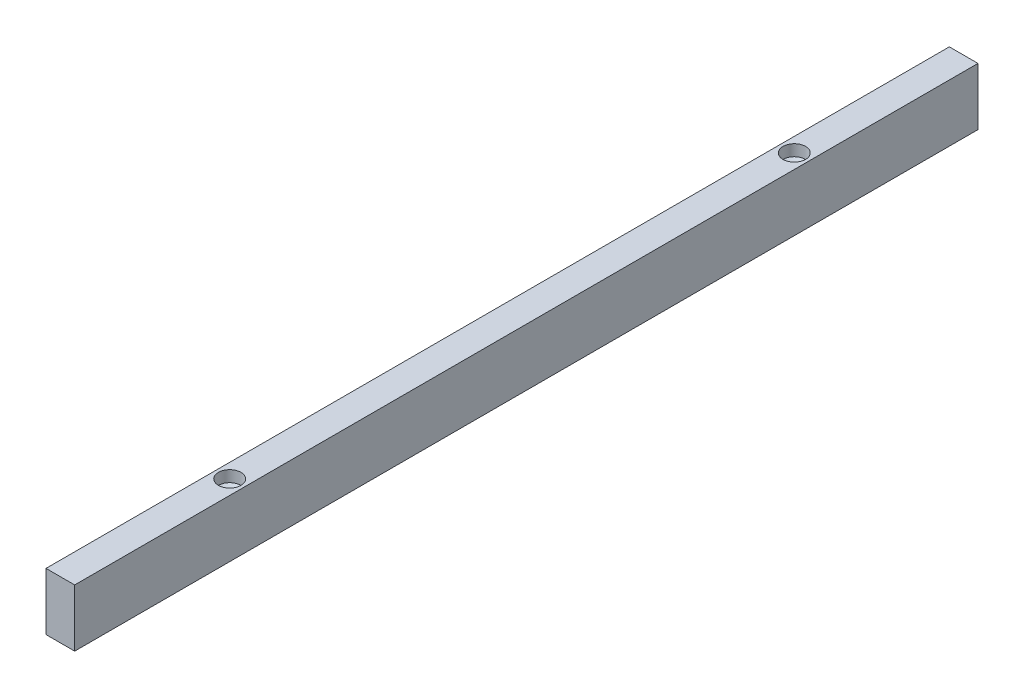
ISO-10303-21;
HEADER;
FILE_DESCRIPTION(('STEP AP214'),'2;1');
FILE_NAME('part.step','',(''),(''),'','','');
FILE_SCHEMA(('AUTOMOTIVE_DESIGN { 1 0 10303 214 1 1 1 1 }'));
ENDSEC;
DATA;
#1=APPLICATION_CONTEXT('core data for automotive mechanical design processes');
#2=APPLICATION_PROTOCOL_DEFINITION('international standard','automotive_design',2000,#1);
#3=PRODUCT_CONTEXT('',#1,'mechanical');
#4=PRODUCT('Part','Part','',(#3));
#5=PRODUCT_RELATED_PRODUCT_CATEGORY('part','',(#4));
#6=PRODUCT_DEFINITION_FORMATION('','',#4);
#7=PRODUCT_DEFINITION_CONTEXT('part definition',#1,'design');
#8=PRODUCT_DEFINITION('design','',#6,#7);
#9=PRODUCT_DEFINITION_SHAPE('','',#8);
#10=(LENGTH_UNIT() NAMED_UNIT(*) SI_UNIT(.MILLI.,.METRE.));
#11=(NAMED_UNIT(*) PLANE_ANGLE_UNIT() SI_UNIT($,.RADIAN.));
#12=(NAMED_UNIT(*) SI_UNIT($,.STERADIAN.) SOLID_ANGLE_UNIT());
#13=UNCERTAINTY_MEASURE_WITH_UNIT(LENGTH_MEASURE(1.E-05),#10,'distance_accuracy_value','');
#14=(GEOMETRIC_REPRESENTATION_CONTEXT(3) GLOBAL_UNCERTAINTY_ASSIGNED_CONTEXT((#13)) GLOBAL_UNIT_ASSIGNED_CONTEXT((#10,
#11,#12)) REPRESENTATION_CONTEXT('',''));
#15=CARTESIAN_POINT('',(0.,0.,0.));
#16=DIRECTION('',(0.,0.,1.));
#17=DIRECTION('',(1.,0.,0.));
#18=AXIS2_PLACEMENT_3D('',#15,#16,#17);
#19=CARTESIAN_POINT('',(6.35,-12.7,-200.));
#20=DIRECTION('',(1.,0.,0.));
#21=DIRECTION('',(0.,1.,0.));
#22=AXIS2_PLACEMENT_3D('',#19,#20,#21);
#23=PLANE('',#22);
#24=DIRECTION('',(0.,0.,1.));
#25=VECTOR('',#24,1.);
#26=CARTESIAN_POINT('',(6.35,12.7,-200.));
#27=LINE('',#26,#25);
#28=CARTESIAN_POINT('',(6.35,12.7,-200.));
#29=VERTEX_POINT('',#28);
#30=CARTESIAN_POINT('',(6.35,12.7,200.));
#31=VERTEX_POINT('',#30);
#32=EDGE_CURVE('E33',#29,#31,#27,.T.);
#33=ORIENTED_EDGE('',*,*,#32,.T.);
#34=DIRECTION('',(0.,1.,0.));
#35=VECTOR('',#34,1.);
#36=CARTESIAN_POINT('',(6.35,-12.7,200.));
#37=LINE('',#36,#35);
#38=CARTESIAN_POINT('',(6.35,-12.7,200.));
#39=VERTEX_POINT('',#38);
#40=EDGE_CURVE('E70',#39,#31,#37,.T.);
#41=ORIENTED_EDGE('',*,*,#40,.F.);
#42=DIRECTION('',(0.,0.,1.));
#43=VECTOR('',#42,1.);
#44=CARTESIAN_POINT('',(6.35,-12.7,-200.));
#45=LINE('',#44,#43);
#46=CARTESIAN_POINT('',(6.35,-12.7,-200.));
#47=VERTEX_POINT('',#46);
#48=EDGE_CURVE('E11',#47,#39,#45,.T.);
#49=ORIENTED_EDGE('',*,*,#48,.F.);
#50=DIRECTION('',(0.,1.,0.));
#51=VECTOR('',#50,1.);
#52=CARTESIAN_POINT('',(6.35,-12.7,-200.));
#53=LINE('',#52,#51);
#54=EDGE_CURVE('E71',#47,#29,#53,.T.);
#55=ORIENTED_EDGE('',*,*,#54,.T.);
#56=EDGE_LOOP('',(#33,#41,#49,#55));
#57=FACE_BOUND('',#56,.T.);
#58=ADVANCED_FACE('F30',(#57),#23,.T.);
#59=CARTESIAN_POINT('',(6.35,-12.7,-200.));
#60=DIRECTION('',(0.,-1.,0.));
#61=DIRECTION('',(0.,0.,-1.));
#62=AXIS2_PLACEMENT_3D('',#59,#60,#61);
#63=PLANE('',#62);
#64=CARTESIAN_POINT('',(0.,-12.7,-125.));
#65=DIRECTION('',(0.,1.,0.));
#66=DIRECTION('',(0.,0.,1.));
#67=AXIS2_PLACEMENT_3D('',#64,#65,#66);
#68=CIRCLE('',#67,1.65);
#69=CARTESIAN_POINT('',(0.,-12.7,-123.35));
#70=VERTEX_POINT('',#69);
#71=EDGE_CURVE('E134',#70,#70,#68,.T.);
#72=ORIENTED_EDGE('',*,*,#71,.T.);
#73=EDGE_LOOP('',(#72));
#74=FACE_BOUND('',#73,.T.);
#75=CARTESIAN_POINT('',(0.,-12.7,125.));
#76=DIRECTION('',(0.,-1.,0.));
#77=DIRECTION('',(0.,0.,-1.));
#78=AXIS2_PLACEMENT_3D('',#75,#76,#77);
#79=CIRCLE('',#78,1.65);
#80=CARTESIAN_POINT('',(0.,-12.7,123.35));
#81=VERTEX_POINT('',#80);
#82=EDGE_CURVE('E137',#81,#81,#79,.T.);
#83=ORIENTED_EDGE('',*,*,#82,.F.);
#84=EDGE_LOOP('',(#83));
#85=FACE_BOUND('',#84,.T.);
#86=ORIENTED_EDGE('',*,*,#48,.T.);
#87=DIRECTION('',(1.,0.,0.));
#88=VECTOR('',#87,1.);
#89=CARTESIAN_POINT('',(6.35,-12.7,200.));
#90=LINE('',#89,#88);
#91=CARTESIAN_POINT('',(-6.35,-12.7,200.));
#92=VERTEX_POINT('',#91);
#93=EDGE_CURVE('E87',#92,#39,#90,.T.);
#94=ORIENTED_EDGE('',*,*,#93,.F.);
#95=DIRECTION('',(0.,0.,1.));
#96=VECTOR('',#95,1.);
#97=CARTESIAN_POINT('',(-6.35,-12.7,-200.));
#98=LINE('',#97,#96);
#99=CARTESIAN_POINT('',(-6.35,-12.7,-200.));
#100=VERTEX_POINT('',#99);
#101=EDGE_CURVE('E38',#100,#92,#98,.T.);
#102=ORIENTED_EDGE('',*,*,#101,.F.);
#103=DIRECTION('',(1.,0.,0.));
#104=VECTOR('',#103,1.);
#105=CARTESIAN_POINT('',(6.35,-12.7,-200.));
#106=LINE('',#105,#104);
#107=EDGE_CURVE('E76',#100,#47,#106,.T.);
#108=ORIENTED_EDGE('',*,*,#107,.T.);
#109=EDGE_LOOP('',(#86,#94,#102,#108));
#110=FACE_BOUND('',#109,.T.);
#111=ADVANCED_FACE('F107',(#74,#85,#110),#63,.T.);
#112=CARTESIAN_POINT('',(-6.35,-12.7,-200.));
#113=DIRECTION('',(-1.,0.,0.));
#114=DIRECTION('',(0.,-1.,0.));
#115=AXIS2_PLACEMENT_3D('',#112,#113,#114);
#116=PLANE('',#115);
#117=ORIENTED_EDGE('',*,*,#101,.T.);
#118=DIRECTION('',(0.,-1.,0.));
#119=VECTOR('',#118,1.);
#120=CARTESIAN_POINT('',(-6.35,-12.7,200.));
#121=LINE('',#120,#119);
#122=CARTESIAN_POINT('',(-6.35,12.7,200.));
#123=VERTEX_POINT('',#122);
#124=EDGE_CURVE('E83',#123,#92,#121,.T.);
#125=ORIENTED_EDGE('',*,*,#124,.F.);
#126=DIRECTION('',(0.,0.,1.));
#127=VECTOR('',#126,1.);
#128=CARTESIAN_POINT('',(-6.35,12.7,-200.));
#129=LINE('',#128,#127);
#130=CARTESIAN_POINT('',(-6.35,12.7,-200.));
#131=VERTEX_POINT('',#130);
#132=EDGE_CURVE('E75',#131,#123,#129,.T.);
#133=ORIENTED_EDGE('',*,*,#132,.F.);
#134=DIRECTION('',(0.,-1.,0.));
#135=VECTOR('',#134,1.);
#136=CARTESIAN_POINT('',(-6.35,-12.7,-200.));
#137=LINE('',#136,#135);
#138=EDGE_CURVE('E100',#131,#100,#137,.T.);
#139=ORIENTED_EDGE('',*,*,#138,.T.);
#140=EDGE_LOOP('',(#117,#125,#133,#139));
#141=FACE_BOUND('',#140,.T.);
#142=ADVANCED_FACE('F104',(#141),#116,.T.);
#143=CARTESIAN_POINT('',(6.35,12.7,-200.));
#144=DIRECTION('',(0.,1.,0.));
#145=DIRECTION('',(0.,0.,1.));
#146=AXIS2_PLACEMENT_3D('',#143,#144,#145);
#147=PLANE('',#146);
#148=CARTESIAN_POINT('',(0.,12.7,-125.));
#149=DIRECTION('',(0.,1.,0.));
#150=DIRECTION('',(0.,0.,1.));
#151=AXIS2_PLACEMENT_3D('',#148,#149,#150);
#152=CIRCLE('',#151,5.);
#153=CARTESIAN_POINT('',(0.,12.7,-120.));
#154=VERTEX_POINT('',#153);
#155=EDGE_CURVE('E140',#154,#154,#152,.T.);
#156=ORIENTED_EDGE('',*,*,#155,.F.);
#157=EDGE_LOOP('',(#156));
#158=FACE_BOUND('',#157,.T.);
#159=CARTESIAN_POINT('',(0.,12.7,125.));
#160=DIRECTION('',(0.,-1.,0.));
#161=DIRECTION('',(0.,0.,-1.));
#162=AXIS2_PLACEMENT_3D('',#159,#160,#161);
#163=CIRCLE('',#162,5.);
#164=CARTESIAN_POINT('',(0.,12.7,120.));
#165=VERTEX_POINT('',#164);
#166=EDGE_CURVE('E88',#165,#165,#163,.T.);
#167=ORIENTED_EDGE('',*,*,#166,.T.);
#168=EDGE_LOOP('',(#167));
#169=FACE_BOUND('',#168,.T.);
#170=ORIENTED_EDGE('',*,*,#132,.T.);
#171=DIRECTION('',(-1.,0.,0.));
#172=VECTOR('',#171,1.);
#173=CARTESIAN_POINT('',(6.35,12.7,200.));
#174=LINE('',#173,#172);
#175=EDGE_CURVE('E78',#31,#123,#174,.T.);
#176=ORIENTED_EDGE('',*,*,#175,.F.);
#177=ORIENTED_EDGE('',*,*,#32,.F.);
#178=DIRECTION('',(-1.,0.,0.));
#179=VECTOR('',#178,1.);
#180=CARTESIAN_POINT('',(6.35,12.7,-200.));
#181=LINE('',#180,#179);
#182=EDGE_CURVE('E98',#29,#131,#181,.T.);
#183=ORIENTED_EDGE('',*,*,#182,.T.);
#184=EDGE_LOOP('',(#170,#176,#177,#183));
#185=FACE_BOUND('',#184,.T.);
#186=ADVANCED_FACE('F79',(#158,#169,#185),#147,.T.);
#187=CARTESIAN_POINT('',(6.35,12.7,-200.));
#188=DIRECTION('',(0.,0.,1.));
#189=DIRECTION('',(1.,0.,0.));
#190=AXIS2_PLACEMENT_3D('',#187,#188,#189);
#191=PLANE('',#190);
#192=ORIENTED_EDGE('',*,*,#54,.F.);
#193=ORIENTED_EDGE('',*,*,#107,.F.);
#194=ORIENTED_EDGE('',*,*,#138,.F.);
#195=ORIENTED_EDGE('',*,*,#182,.F.);
#196=EDGE_LOOP('',(#192,#193,#194,#195));
#197=FACE_BOUND('',#196,.T.);
#198=ADVANCED_FACE('F109',(#197),#191,.F.);
#199=CARTESIAN_POINT('',(6.35,12.7,200.));
#200=DIRECTION('',(0.,0.,1.));
#201=DIRECTION('',(1.,0.,0.));
#202=AXIS2_PLACEMENT_3D('',#199,#200,#201);
#203=PLANE('',#202);
#204=ORIENTED_EDGE('',*,*,#40,.T.);
#205=ORIENTED_EDGE('',*,*,#175,.T.);
#206=ORIENTED_EDGE('',*,*,#124,.T.);
#207=ORIENTED_EDGE('',*,*,#93,.T.);
#208=EDGE_LOOP('',(#204,#205,#206,#207));
#209=FACE_BOUND('',#208,.T.);
#210=ADVANCED_FACE('F86',(#209),#203,.T.);
#211=CARTESIAN_POINT('',(0.,-12.7,125.));
#212=DIRECTION('',(0.,-1.,0.));
#213=DIRECTION('',(0.,0.,-1.));
#214=AXIS2_PLACEMENT_3D('',#211,#212,#213);
#215=CYLINDRICAL_SURFACE('',#214,5.);
#216=ORIENTED_EDGE('',*,*,#166,.F.);
#217=EDGE_LOOP('',(#216));
#218=FACE_BOUND('',#217,.T.);
#219=CARTESIAN_POINT('',(0.,7.7,125.));
#220=DIRECTION('',(0.,-1.,0.));
#221=DIRECTION('',(0.,0.,-1.));
#222=AXIS2_PLACEMENT_3D('',#219,#220,#221);
#223=CIRCLE('',#222,5.);
#224=CARTESIAN_POINT('',(0.,7.7,120.));
#225=VERTEX_POINT('',#224);
#226=EDGE_CURVE('E91',#225,#225,#223,.T.);
#227=ORIENTED_EDGE('',*,*,#226,.T.);
#228=EDGE_LOOP('',(#227));
#229=FACE_BOUND('',#228,.T.);
#230=ADVANCED_FACE('F116',(#218,#229),#215,.F.);
#231=CARTESIAN_POINT('',(0.,6.54529946162073,125.));
#232=DIRECTION('',(0.,1.,0.));
#233=DIRECTION('',(0.,0.,1.));
#234=AXIS2_PLACEMENT_3D('',#231,#232,#233);
#235=CONICAL_SURFACE('',#234,3.,1.04719755119659);
#236=ORIENTED_EDGE('',*,*,#226,.F.);
#237=EDGE_LOOP('',(#236));
#238=FACE_BOUND('',#237,.T.);
#239=CARTESIAN_POINT('',(0.,6.54529946162073,125.));
#240=DIRECTION('',(0.,-1.,0.));
#241=DIRECTION('',(0.,0.,-1.));
#242=AXIS2_PLACEMENT_3D('',#239,#240,#241);
#243=CIRCLE('',#242,3.);
#244=CARTESIAN_POINT('',(0.,6.54529946162073,122.));
#245=VERTEX_POINT('',#244);
#246=EDGE_CURVE('E152',#245,#245,#243,.T.);
#247=ORIENTED_EDGE('',*,*,#246,.T.);
#248=EDGE_LOOP('',(#247));
#249=FACE_BOUND('',#248,.T.);
#250=ADVANCED_FACE('F158',(#238,#249),#235,.F.);
#251=CARTESIAN_POINT('',(0.,-12.7,125.));
#252=DIRECTION('',(0.,-1.,0.));
#253=DIRECTION('',(0.,0.,-1.));
#254=AXIS2_PLACEMENT_3D('',#251,#252,#253);
#255=CYLINDRICAL_SURFACE('',#254,3.);
#256=ORIENTED_EDGE('',*,*,#246,.F.);
#257=EDGE_LOOP('',(#256));
#258=FACE_BOUND('',#257,.T.);
#259=CARTESIAN_POINT('',(0.,-2.3,125.));
#260=DIRECTION('',(0.,-1.,0.));
#261=DIRECTION('',(0.,0.,-1.));
#262=AXIS2_PLACEMENT_3D('',#259,#260,#261);
#263=CIRCLE('',#262,3.);
#264=CARTESIAN_POINT('',(0.,-2.3,122.));
#265=VERTEX_POINT('',#264);
#266=EDGE_CURVE('E143',#265,#265,#263,.T.);
#267=ORIENTED_EDGE('',*,*,#266,.T.);
#268=EDGE_LOOP('',(#267));
#269=FACE_BOUND('',#268,.T.);
#270=ADVANCED_FACE('F161',(#258,#269),#255,.F.);
#271=CARTESIAN_POINT('',(0.,-3.07942286340601,125.));
#272=DIRECTION('',(0.,1.,0.));
#273=DIRECTION('',(0.,0.,1.));
#274=AXIS2_PLACEMENT_3D('',#271,#272,#273);
#275=CONICAL_SURFACE('',#274,1.65,1.04719755119659);
#276=ORIENTED_EDGE('',*,*,#266,.F.);
#277=EDGE_LOOP('',(#276));
#278=FACE_BOUND('',#277,.T.);
#279=CARTESIAN_POINT('',(0.,-3.07942286340601,125.));
#280=DIRECTION('',(0.,-1.,0.));
#281=DIRECTION('',(0.,0.,-1.));
#282=AXIS2_PLACEMENT_3D('',#279,#280,#281);
#283=CIRCLE('',#282,1.65);
#284=CARTESIAN_POINT('',(0.,-3.07942286340601,123.35));
#285=VERTEX_POINT('',#284);
#286=EDGE_CURVE('E139',#285,#285,#283,.T.);
#287=ORIENTED_EDGE('',*,*,#286,.T.);
#288=EDGE_LOOP('',(#287));
#289=FACE_BOUND('',#288,.T.);
#290=ADVANCED_FACE('F167',(#278,#289),#275,.F.);
#291=CARTESIAN_POINT('',(0.,-12.7,125.));
#292=DIRECTION('',(0.,-1.,0.));
#293=DIRECTION('',(0.,0.,-1.));
#294=AXIS2_PLACEMENT_3D('',#291,#292,#293);
#295=CYLINDRICAL_SURFACE('',#294,1.65);
#296=ORIENTED_EDGE('',*,*,#286,.F.);
#297=EDGE_LOOP('',(#296));
#298=FACE_BOUND('',#297,.T.);
#299=ORIENTED_EDGE('',*,*,#82,.T.);
#300=EDGE_LOOP('',(#299));
#301=FACE_BOUND('',#300,.T.);
#302=ADVANCED_FACE('F173',(#298,#301),#295,.F.);
#303=CARTESIAN_POINT('',(0.,-12.7,-125.));
#304=DIRECTION('',(0.,-1.,0.));
#305=DIRECTION('',(0.,0.,1.));
#306=AXIS2_PLACEMENT_3D('',#303,#304,#305);
#307=CYLINDRICAL_SURFACE('',#306,5.);
#308=ORIENTED_EDGE('',*,*,#155,.T.);
#309=EDGE_LOOP('',(#308));
#310=FACE_BOUND('',#309,.T.);
#311=CARTESIAN_POINT('',(0.,7.7,-125.));
#312=DIRECTION('',(0.,1.,0.));
#313=DIRECTION('',(0.,0.,1.));
#314=AXIS2_PLACEMENT_3D('',#311,#312,#313);
#315=CIRCLE('',#314,5.);
#316=CARTESIAN_POINT('',(0.,7.7,-120.));
#317=VERTEX_POINT('',#316);
#318=EDGE_CURVE('E146',#317,#317,#315,.T.);
#319=ORIENTED_EDGE('',*,*,#318,.F.);
#320=EDGE_LOOP('',(#319));
#321=FACE_BOUND('',#320,.T.);
#322=ADVANCED_FACE('F178',(#310,#321),#307,.F.);
#323=CARTESIAN_POINT('',(0.,6.54529946162073,-125.));
#324=DIRECTION('',(0.,1.,0.));
#325=DIRECTION('',(0.,0.,-1.));
#326=AXIS2_PLACEMENT_3D('',#323,#324,#325);
#327=CONICAL_SURFACE('',#326,3.,1.04719755119659);
#328=ORIENTED_EDGE('',*,*,#318,.T.);
#329=EDGE_LOOP('',(#328));
#330=FACE_BOUND('',#329,.T.);
#331=CARTESIAN_POINT('',(0.,6.54529946162073,-125.));
#332=DIRECTION('',(0.,1.,0.));
#333=DIRECTION('',(0.,0.,1.));
#334=AXIS2_PLACEMENT_3D('',#331,#332,#333);
#335=CIRCLE('',#334,3.);
#336=CARTESIAN_POINT('',(0.,6.54529946162073,-122.));
#337=VERTEX_POINT('',#336);
#338=EDGE_CURVE('E269',#337,#337,#335,.T.);
#339=ORIENTED_EDGE('',*,*,#338,.F.);
#340=EDGE_LOOP('',(#339));
#341=FACE_BOUND('',#340,.T.);
#342=ADVANCED_FACE('F182',(#330,#341),#327,.F.);
#343=CARTESIAN_POINT('',(0.,-12.7,-125.));
#344=DIRECTION('',(0.,-1.,0.));
#345=DIRECTION('',(0.,0.,1.));
#346=AXIS2_PLACEMENT_3D('',#343,#344,#345);
#347=CYLINDRICAL_SURFACE('',#346,3.);
#348=ORIENTED_EDGE('',*,*,#338,.T.);
#349=EDGE_LOOP('',(#348));
#350=FACE_BOUND('',#349,.T.);
#351=CARTESIAN_POINT('',(0.,-2.3,-125.));
#352=DIRECTION('',(0.,1.,0.));
#353=DIRECTION('',(0.,0.,1.));
#354=AXIS2_PLACEMENT_3D('',#351,#352,#353);
#355=CIRCLE('',#354,3.);
#356=CARTESIAN_POINT('',(0.,-2.3,-122.));
#357=VERTEX_POINT('',#356);
#358=EDGE_CURVE('E264',#357,#357,#355,.T.);
#359=ORIENTED_EDGE('',*,*,#358,.F.);
#360=EDGE_LOOP('',(#359));
#361=FACE_BOUND('',#360,.T.);
#362=ADVANCED_FACE('F226',(#350,#361),#347,.F.);
#363=CARTESIAN_POINT('',(0.,-3.07942286340601,-125.));
#364=DIRECTION('',(0.,1.,0.));
#365=DIRECTION('',(0.,0.,-1.));
#366=AXIS2_PLACEMENT_3D('',#363,#364,#365);
#367=CONICAL_SURFACE('',#366,1.65,1.04719755119659);
#368=ORIENTED_EDGE('',*,*,#358,.T.);
#369=EDGE_LOOP('',(#368));
#370=FACE_BOUND('',#369,.T.);
#371=CARTESIAN_POINT('',(0.,-3.07942286340601,-125.));
#372=DIRECTION('',(0.,1.,0.));
#373=DIRECTION('',(0.,0.,1.));
#374=AXIS2_PLACEMENT_3D('',#371,#372,#373);
#375=CIRCLE('',#374,1.65);
#376=CARTESIAN_POINT('',(0.,-3.07942286340601,-123.35));
#377=VERTEX_POINT('',#376);
#378=EDGE_CURVE('E262',#377,#377,#375,.T.);
#379=ORIENTED_EDGE('',*,*,#378,.F.);
#380=EDGE_LOOP('',(#379));
#381=FACE_BOUND('',#380,.T.);
#382=ADVANCED_FACE('F234',(#370,#381),#367,.F.);
#383=CARTESIAN_POINT('',(0.,-12.7,-125.));
#384=DIRECTION('',(0.,-1.,0.));
#385=DIRECTION('',(0.,0.,1.));
#386=AXIS2_PLACEMENT_3D('',#383,#384,#385);
#387=CYLINDRICAL_SURFACE('',#386,1.65);
#388=ORIENTED_EDGE('',*,*,#378,.T.);
#389=EDGE_LOOP('',(#388));
#390=FACE_BOUND('',#389,.T.);
#391=ORIENTED_EDGE('',*,*,#71,.F.);
#392=EDGE_LOOP('',(#391));
#393=FACE_BOUND('',#392,.T.);
#394=ADVANCED_FACE('F243',(#390,#393),#387,.F.);
#395=CLOSED_SHELL('',(#58,#111,#142,#186,#198,#210,#230,#250,#270,#290,#302,#322,#342,#362,#382,#394));
#396=MANIFOLD_SOLID_BREP('B2',#395);
#397=ADVANCED_BREP_SHAPE_REPRESENTATION('',(#18,#396),#14);
#398=SHAPE_DEFINITION_REPRESENTATION(#9,#397);
ENDSEC;
END-ISO-10303-21;
